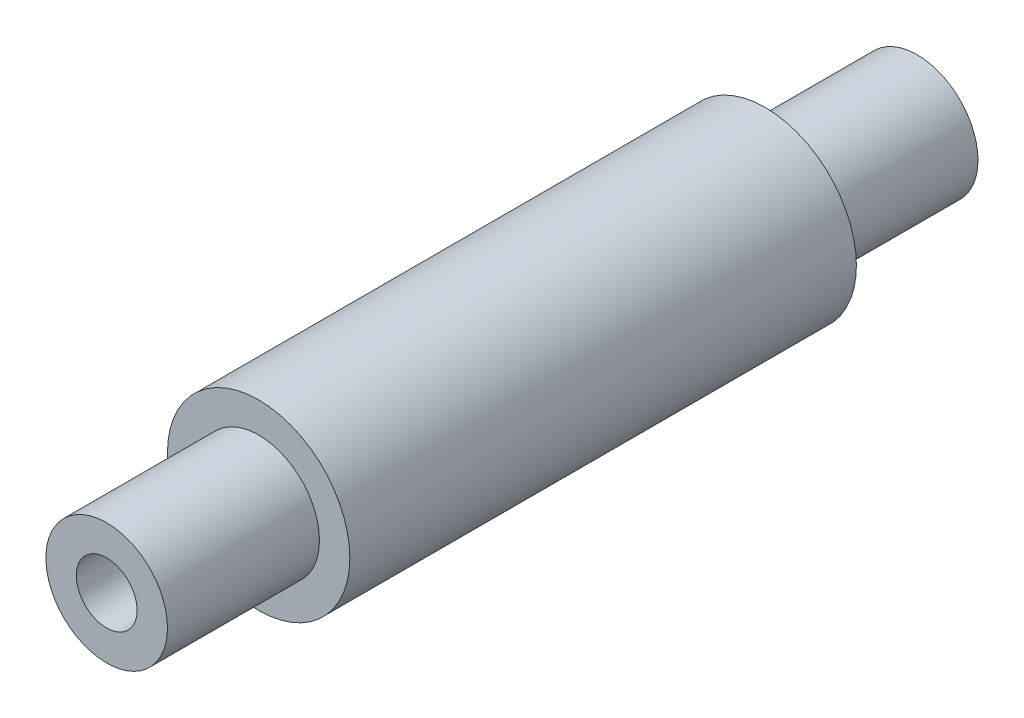
ISO-10303-21;
HEADER;
FILE_DESCRIPTION(('STEP AP214'),'2;1');
FILE_NAME('part.step','',(''),(''),'','','');
FILE_SCHEMA(('AUTOMOTIVE_DESIGN { 1 0 10303 214 1 1 1 1 }'));
ENDSEC;
DATA;
#1=APPLICATION_CONTEXT('core data for automotive mechanical design processes');
#2=APPLICATION_PROTOCOL_DEFINITION('international standard','automotive_design',2000,#1);
#3=PRODUCT_CONTEXT('',#1,'mechanical');
#4=PRODUCT('Part','Part','',(#3));
#5=PRODUCT_RELATED_PRODUCT_CATEGORY('part','',(#4));
#6=PRODUCT_DEFINITION_FORMATION('','',#4);
#7=PRODUCT_DEFINITION_CONTEXT('part definition',#1,'design');
#8=PRODUCT_DEFINITION('design','',#6,#7);
#9=PRODUCT_DEFINITION_SHAPE('','',#8);
#10=(LENGTH_UNIT() NAMED_UNIT(*) SI_UNIT(.MILLI.,.METRE.));
#11=(NAMED_UNIT(*) PLANE_ANGLE_UNIT() SI_UNIT($,.RADIAN.));
#12=(NAMED_UNIT(*) SI_UNIT($,.STERADIAN.) SOLID_ANGLE_UNIT());
#13=UNCERTAINTY_MEASURE_WITH_UNIT(LENGTH_MEASURE(1.E-05),#10,'distance_accuracy_value','');
#14=(GEOMETRIC_REPRESENTATION_CONTEXT(3) GLOBAL_UNCERTAINTY_ASSIGNED_CONTEXT((#13)) GLOBAL_UNIT_ASSIGNED_CONTEXT((#10,
#11,#12)) REPRESENTATION_CONTEXT('',''));
#15=CARTESIAN_POINT('',(0.,0.,0.));
#16=DIRECTION('',(0.,0.,1.));
#17=DIRECTION('',(1.,0.,0.));
#18=AXIS2_PLACEMENT_3D('',#15,#16,#17);
#19=CARTESIAN_POINT('',(0.,0.,40.));
#20=DIRECTION('',(0.,0.,-1.));
#21=DIRECTION('',(-1.,0.,0.));
#22=AXIS2_PLACEMENT_3D('',#19,#20,#21);
#23=CYLINDRICAL_SURFACE('',#22,6.);
#24=CARTESIAN_POINT('',(0.,0.,25.));
#25=DIRECTION('',(0.,0.,1.));
#26=DIRECTION('',(1.,0.,0.));
#27=AXIS2_PLACEMENT_3D('',#24,#25,#26);
#28=CIRCLE('',#27,6.);
#29=CARTESIAN_POINT('',(6.,0.,25.));
#30=VERTEX_POINT('',#29);
#31=EDGE_CURVE('E83',#30,#30,#28,.T.);
#32=ORIENTED_EDGE('',*,*,#31,.T.);
#33=EDGE_LOOP('',(#32));
#34=FACE_BOUND('',#33,.T.);
#35=CARTESIAN_POINT('',(0.,0.,40.));
#36=DIRECTION('',(0.,0.,1.));
#37=DIRECTION('',(1.,0.,0.));
#38=AXIS2_PLACEMENT_3D('',#35,#36,#37);
#39=CIRCLE('',#38,6.);
#40=CARTESIAN_POINT('',(6.,0.,40.));
#41=VERTEX_POINT('',#40);
#42=EDGE_CURVE('E86',#41,#41,#39,.T.);
#43=ORIENTED_EDGE('',*,*,#42,.F.);
#44=EDGE_LOOP('',(#43));
#45=FACE_BOUND('',#44,.T.);
#46=ADVANCED_FACE('F42',(#34,#45),#23,.T.);
#47=CARTESIAN_POINT('',(0.,0.,40.));
#48=DIRECTION('',(0.,0.,1.));
#49=DIRECTION('',(1.,0.,0.));
#50=AXIS2_PLACEMENT_3D('',#47,#48,#49);
#51=PLANE('',#50);
#52=CARTESIAN_POINT('',(0.,0.,40.));
#53=DIRECTION('',(0.,0.,1.));
#54=DIRECTION('',(1.,0.,0.));
#55=AXIS2_PLACEMENT_3D('',#52,#53,#54);
#56=CIRCLE('',#55,3.);
#57=CARTESIAN_POINT('',(3.,0.,40.));
#58=VERTEX_POINT('',#57);
#59=EDGE_CURVE('E71',#58,#58,#56,.T.);
#60=ORIENTED_EDGE('',*,*,#59,.F.);
#61=EDGE_LOOP('',(#60));
#62=FACE_BOUND('',#61,.T.);
#63=ORIENTED_EDGE('',*,*,#42,.T.);
#64=EDGE_LOOP('',(#63));
#65=FACE_BOUND('',#64,.T.);
#66=ADVANCED_FACE('F109',(#62,#65),#51,.T.);
#67=CARTESIAN_POINT('',(0.,0.,25.));
#68=DIRECTION('',(0.,0.,-1.));
#69=DIRECTION('',(-1.,0.,0.));
#70=AXIS2_PLACEMENT_3D('',#67,#68,#69);
#71=CYLINDRICAL_SURFACE('',#70,9.);
#72=CARTESIAN_POINT('',(-9.,0.,-3.));
#73=CARTESIAN_POINT('',(-9.00000045902832,0.16369008866017,-3.00000076119492));
#74=CARTESIAN_POINT('',(-8.99549308522634,0.32737558361565,-2.98655920161835));
#75=CARTESIAN_POINT('',(-8.97795630609842,0.649925282618917,-2.93331267354834));
#76=CARTESIAN_POINT('',(-8.96492601606458,0.808788984356453,-2.89350496815323));
#77=CARTESIAN_POINT('',(-8.93175923719328,1.11699836850533,-2.78904226984785));
#78=CARTESIAN_POINT('',(-8.9116346319256,1.2663594776581,-2.72442881262218));
#79=CARTESIAN_POINT('',(-8.86633337152025,1.55212481041597,-2.57237648148496));
#80=CARTESIAN_POINT('',(-8.84115572003334,1.68852647087612,-2.4849331049922));
#81=CARTESIAN_POINT('',(-8.78742283329015,1.9492250250668,-2.28652258542374));
#82=CARTESIAN_POINT('',(-8.75878669391354,2.07301110089493,-2.17490629721852));
#83=CARTESIAN_POINT('',(-8.70180944349364,2.30049807810625,-1.9326985358803));
#84=CARTESIAN_POINT('',(-8.67346839871647,2.40419455646839,-1.80210289521446));
#85=CARTESIAN_POINT('',(-8.61939997431821,2.59147482668358,-1.52104465441062));
#86=CARTESIAN_POINT('',(-8.59377117827064,2.6743945746631,-1.37011878080363));
#87=CARTESIAN_POINT('',(-8.54925916255804,2.81345662163316,-1.05547171662436));
#88=CARTESIAN_POINT('',(-8.53037388482237,2.86960709216029,-0.891754448511768));
#89=CARTESIAN_POINT('',(-8.50233909808132,2.95162038452749,-0.561980335509868));
#90=CARTESIAN_POINT('',(-8.49288287308834,2.97844034481531,-0.396188374532806));
#91=CARTESIAN_POINT('',(-8.48386969888523,3.00402337000343,-0.0622087375323572));
#92=CARTESIAN_POINT('',(-8.4843096906819,3.00279510481415,0.105978182127571));
#93=CARTESIAN_POINT('',(-8.49477045024541,2.97305971111026,0.431809891332063));
#94=CARTESIAN_POINT('',(-8.50435247602599,2.94580173950098,0.589585208757056));
#95=CARTESIAN_POINT('',(-8.53129973173653,2.86681848854825,0.898180258820503));
#96=CARTESIAN_POINT('',(-8.54866589352323,2.81509027977561,1.04899915630521));
#97=CARTESIAN_POINT('',(-8.58953733393746,2.68781717418063,1.34223824877444));
#98=CARTESIAN_POINT('',(-8.61313697379352,2.61190214612179,1.48448407640858));
#99=CARTESIAN_POINT('',(-8.66377675727179,2.43866731890942,1.75461272483918));
#100=CARTESIAN_POINT('',(-8.69081789371391,2.34134133709202,1.88249138080014));
#101=CARTESIAN_POINT('',(-8.74701987503223,2.12204799804671,2.12727479448232));
#102=CARTESIAN_POINT('',(-8.77621768064528,1.99905945022893,2.24325808352721));
#103=CARTESIAN_POINT('',(-8.8322081516111,1.73501870991019,2.45319379999019));
#104=CARTESIAN_POINT('',(-8.85900058614202,1.59396478698244,2.54714411449349));
#105=CARTESIAN_POINT('',(-8.90751323813381,1.2958428391388,2.7110889007052));
#106=CARTESIAN_POINT('',(-8.92918050024118,1.13862982924901,2.78083647402219));
#107=CARTESIAN_POINT('',(-8.96461701433304,0.813807250093523,2.89260952186713));
#108=CARTESIAN_POINT('',(-8.97838900964638,0.646201314464861,2.93464462627031));
#109=CARTESIAN_POINT('',(-8.99602881214321,0.313151488587913,2.98816699806708));
#110=CARTESIAN_POINT('',(-9.00030005501184,0.14792879959454,3.00089942751825));
#111=CARTESIAN_POINT('',(-8.99966708084482,-0.182325209880711,2.99900197920459));
#112=CARTESIAN_POINT('',(-8.99476441258087,-0.34735655795895,2.98437672006037));
#113=CARTESIAN_POINT('',(-8.97660074151313,-0.667559598912766,2.92916427679212));
#114=CARTESIAN_POINT('',(-8.96358596133577,-0.822878420504529,2.88934138185152));
#115=CARTESIAN_POINT('',(-8.9307554049021,-1.12456787573872,2.78581966659981));
#116=CARTESIAN_POINT('',(-8.91093876140025,-1.27093736552582,2.72211780159664));
#117=CARTESIAN_POINT('',(-8.86586793861869,-1.55486488917982,2.57078870447764));
#118=CARTESIAN_POINT('',(-8.84048444267358,-1.69208987765144,2.48257622015049));
#119=CARTESIAN_POINT('',(-8.78715761748787,-1.95019449040676,2.28541754995955));
#120=CARTESIAN_POINT('',(-8.75921350781483,-2.07106910338673,2.1764650319047));
#121=CARTESIAN_POINT('',(-8.70230543941334,-2.2987575234189,1.93506374698024));
#122=CARTESIAN_POINT('',(-8.67335283262284,-2.40468290773731,1.80177231921942));
#123=CARTESIAN_POINT('',(-8.61899919884126,-2.59277256697072,1.51868529656734));
#124=CARTESIAN_POINT('',(-8.59359820146007,-2.67493664379304,1.36888956409777));
#125=CARTESIAN_POINT('',(-8.54947175374151,-2.81279079124908,1.05698095413031));
#126=CARTESIAN_POINT('',(-8.53073282378936,-2.86853439649506,0.894893762493704));
#127=CARTESIAN_POINT('',(-8.50232496919349,-2.95168400027807,0.562864049867609));
#128=CARTESIAN_POINT('',(-8.49265195870918,-2.97910276486182,0.392925103786952));
#129=CARTESIAN_POINT('',(-8.48393576622531,-3.00382884743203,0.0594087118772523));
#130=CARTESIAN_POINT('',(-8.48437200772245,-3.0026107719252,-0.104047020860469));
#131=CARTESIAN_POINT('',(-8.49453809471602,-2.97372688034608,-0.428295224766186));
#132=CARTESIAN_POINT('',(-8.50426738708085,-2.94606263837576,-0.589087853865264));
#133=CARTESIAN_POINT('',(-8.53153572914675,-2.86611543938804,-0.900406989007415));
#134=CARTESIAN_POINT('',(-8.54892294067433,-2.81431003804654,-1.05107047501349));
#135=CARTESIAN_POINT('',(-8.58949196455406,-2.68793809727924,-1.34168222081481));
#136=CARTESIAN_POINT('',(-8.61267506290179,-2.61336650566142,-1.48162809356402));
#137=CARTESIAN_POINT('',(-8.66348487678139,-2.43978207775029,-1.75345100976873));
#138=CARTESIAN_POINT('',(-8.69126134926411,-2.33984472829374,-1.88470950569516));
#139=CARTESIAN_POINT('',(-8.74750068849758,-2.11992864940695,-2.1290694401526));
#140=CARTESIAN_POINT('',(-8.77596374737117,-1.99994425335445,-2.24216572706422));
#141=CARTESIAN_POINT('',(-8.83170091576632,-1.73772467076207,-2.45143323686753));
#142=CARTESIAN_POINT('',(-8.8588854540377,-1.59480454049919,-2.546773043253));
#143=CARTESIAN_POINT('',(-8.90777973517836,-1.29407207221987,-2.71197128655194));
#144=CARTESIAN_POINT('',(-8.92949087723789,-1.13626355439705,-2.78183623776613));
#145=CARTESIAN_POINT('',(-8.96416545205625,-0.817480941602929,-2.89116489746601));
#146=CARTESIAN_POINT('',(-8.97747637267568,-0.656963273029228,-2.93184739879013));
#147=CARTESIAN_POINT('',(-8.99539221192665,-0.330961248030743,-2.98626084203138));
#148=CARTESIAN_POINT('',(-8.99999953595715,-0.16547827670624,-2.99999923048961));
#149=CARTESIAN_POINT('',(-9.,0.,-3.));
#150=B_SPLINE_CURVE_WITH_KNOTS('',3,(#72,#73,#74,#75,#76,#77,#78,#79,#80,#81,#82,#83,#84,#85,
#86,#87,#88,#89,#90,#91,#92,#93,#94,#95,#96,#97,#98,#99,#100,#101,#102,#103,#104,#105,#106,#107,
#108,#109,#110,#111,#112,#113,#114,#115,#116,#117,#118,#119,#120,#121,#122,#123,#124,#125,#126,
#127,#128,#129,#130,#131,#132,#133,#134,#135,#136,#137,#138,#139,#140,#141,#142,#143,#144,#145,
#146,#147,#148,#149),.UNSPECIFIED.,.T.,.F.,(4,2,2,2,2,2,2,2,2,2,2,2,2,2,2,2,2,2,2,2,2,2,2,2,2,2,
2,2,2,2,2,2,2,2,2,2,2,2,4),(0.,0.490461318078033,0.980973555802562,1.47066801861082,
1.9604591333973,2.46554052848268,2.97073299862591,3.49045154470411,4.010011340785,
4.5120577722552,5.01394901962456,5.49290479653841,5.97191792566446,6.45864513465392,
6.94551307674621,7.45779917434101,7.97013437899855,8.48755216951072,9.00479006631624,
9.49960749525508,9.99434139492529,10.4747447393464,10.9552093585231,11.4483119953121,
11.9415654246567,12.4572306864225,12.9729002470499,13.4875204148031,14.0019085411752,
14.4898699819277,14.9778023805412,15.4564676124125,15.9352391452793,16.4349020007541,
16.9347063337134,17.453989825053,17.9731404345737,18.4690967512144,18.9649159811442),.UNSPECIFIED.);
#151=CARTESIAN_POINT('',(-9.,0.,-3.));
#152=VERTEX_POINT('',#151);
#153=EDGE_CURVE('E73',#152,#152,#150,.T.);
#154=ORIENTED_EDGE('',*,*,#153,.T.);
#155=EDGE_LOOP('',(#154));
#156=FACE_BOUND('',#155,.T.);
#157=CARTESIAN_POINT('',(0.,0.,25.));
#158=DIRECTION('',(0.,0.,1.));
#159=DIRECTION('',(1.,0.,0.));
#160=AXIS2_PLACEMENT_3D('',#157,#158,#159);
#161=CIRCLE('',#160,9.);
#162=CARTESIAN_POINT('',(9.,0.,25.));
#163=VERTEX_POINT('',#162);
#164=EDGE_CURVE('E80',#163,#163,#161,.T.);
#165=ORIENTED_EDGE('',*,*,#164,.F.);
#166=EDGE_LOOP('',(#165));
#167=FACE_BOUND('',#166,.T.);
#168=CARTESIAN_POINT('',(0.,0.,-25.));
#169=DIRECTION('',(0.,0.,1.));
#170=DIRECTION('',(1.,0.,0.));
#171=AXIS2_PLACEMENT_3D('',#168,#169,#170);
#172=CIRCLE('',#171,9.);
#173=CARTESIAN_POINT('',(9.,0.,-25.));
#174=VERTEX_POINT('',#173);
#175=EDGE_CURVE('E75',#174,#174,#172,.T.);
#176=ORIENTED_EDGE('',*,*,#175,.T.);
#177=EDGE_LOOP('',(#176));
#178=FACE_BOUND('',#177,.T.);
#179=ADVANCED_FACE('F103',(#156,#167,#178),#71,.T.);
#180=CARTESIAN_POINT('',(0.,0.,25.));
#181=DIRECTION('',(0.,0.,1.));
#182=DIRECTION('',(1.,0.,0.));
#183=AXIS2_PLACEMENT_3D('',#180,#181,#182);
#184=PLANE('',#183);
#185=ORIENTED_EDGE('',*,*,#31,.F.);
#186=EDGE_LOOP('',(#185));
#187=FACE_BOUND('',#186,.T.);
#188=ORIENTED_EDGE('',*,*,#164,.T.);
#189=EDGE_LOOP('',(#188));
#190=FACE_BOUND('',#189,.T.);
#191=ADVANCED_FACE('F99',(#187,#190),#184,.T.);
#192=CARTESIAN_POINT('',(0.,0.,-25.));
#193=DIRECTION('',(0.,0.,1.));
#194=DIRECTION('',(1.,0.,0.));
#195=AXIS2_PLACEMENT_3D('',#192,#193,#194);
#196=PLANE('',#195);
#197=CARTESIAN_POINT('',(0.,0.,-25.));
#198=DIRECTION('',(0.,0.,1.));
#199=DIRECTION('',(1.,0.,0.));
#200=AXIS2_PLACEMENT_3D('',#197,#198,#199);
#201=CIRCLE('',#200,6.);
#202=CARTESIAN_POINT('',(6.,0.,-25.));
#203=VERTEX_POINT('',#202);
#204=EDGE_CURVE('E58',#203,#203,#201,.T.);
#205=ORIENTED_EDGE('',*,*,#204,.T.);
#206=EDGE_LOOP('',(#205));
#207=FACE_BOUND('',#206,.T.);
#208=ORIENTED_EDGE('',*,*,#175,.F.);
#209=EDGE_LOOP('',(#208));
#210=FACE_BOUND('',#209,.T.);
#211=ADVANCED_FACE('F102',(#207,#210),#196,.F.);
#212=CARTESIAN_POINT('',(0.,0.,-40.));
#213=DIRECTION('',(0.,0.,1.));
#214=DIRECTION('',(1.,0.,0.));
#215=AXIS2_PLACEMENT_3D('',#212,#213,#214);
#216=PLANE('',#215);
#217=CARTESIAN_POINT('',(0.,0.,-40.));
#218=DIRECTION('',(0.,0.,1.));
#219=DIRECTION('',(1.,0.,0.));
#220=AXIS2_PLACEMENT_3D('',#217,#218,#219);
#221=CIRCLE('',#220,6.);
#222=CARTESIAN_POINT('',(6.,0.,-40.));
#223=VERTEX_POINT('',#222);
#224=EDGE_CURVE('E89',#223,#223,#221,.T.);
#225=ORIENTED_EDGE('',*,*,#224,.F.);
#226=EDGE_LOOP('',(#225));
#227=FACE_BOUND('',#226,.T.);
#228=ADVANCED_FACE('F115',(#227),#216,.F.);
#229=ORIENTED_EDGE('',*,*,#224,.T.);
#230=EDGE_LOOP('',(#229));
#231=FACE_BOUND('',#230,.T.);
#232=ORIENTED_EDGE('',*,*,#204,.F.);
#233=EDGE_LOOP('',(#232));
#234=FACE_BOUND('',#233,.T.);
#235=ADVANCED_FACE('F63',(#231,#234),#23,.T.);
#236=CARTESIAN_POINT('',(0.,0.,-5.));
#237=DIRECTION('',(0.,0.,1.));
#238=DIRECTION('',(1.,0.,0.));
#239=AXIS2_PLACEMENT_3D('',#236,#237,#238);
#240=CYLINDRICAL_SURFACE('',#239,3.);
#241=CARTESIAN_POINT('',(0.,0.,0.));
#242=DIRECTION('',(-0.707106781186548,0.,0.707106781186547));
#243=DIRECTION('',(0.707106781186548,0.,0.707106781186547));
#244=AXIS2_PLACEMENT_3D('',#241,#242,#243);
#245=ELLIPSE('',#244,4.24264068711928,3.);
#246=CARTESIAN_POINT('',(0.,3.,0.));
#247=VERTEX_POINT('',#246);
#248=CARTESIAN_POINT('',(0.,-3.,0.));
#249=VERTEX_POINT('',#248);
#250=EDGE_CURVE('E49',#247,#249,#245,.T.);
#251=ORIENTED_EDGE('',*,*,#250,.T.);
#252=CARTESIAN_POINT('',(0.,0.,0.));
#253=DIRECTION('',(0.707106781186548,0.,0.707106781186547));
#254=DIRECTION('',(-0.707106781186548,0.,0.707106781186547));
#255=AXIS2_PLACEMENT_3D('',#252,#253,#254);
#256=ELLIPSE('',#255,4.24264068711928,3.);
#257=EDGE_CURVE('E11',#249,#247,#256,.F.);
#258=ORIENTED_EDGE('',*,*,#257,.T.);
#259=EDGE_LOOP('',(#251,#258));
#260=FACE_BOUND('',#259,.T.);
#261=CARTESIAN_POINT('',(0.,0.,-5.));
#262=DIRECTION('',(0.,0.,1.));
#263=DIRECTION('',(1.,0.,0.));
#264=AXIS2_PLACEMENT_3D('',#261,#262,#263);
#265=CIRCLE('',#264,3.);
#266=CARTESIAN_POINT('',(3.,0.,-5.));
#267=VERTEX_POINT('',#266);
#268=EDGE_CURVE('E68',#267,#267,#265,.T.);
#269=ORIENTED_EDGE('',*,*,#268,.F.);
#270=EDGE_LOOP('',(#269));
#271=FACE_BOUND('',#270,.T.);
#272=ORIENTED_EDGE('',*,*,#59,.T.);
#273=EDGE_LOOP('',(#272));
#274=FACE_BOUND('',#273,.T.);
#275=ADVANCED_FACE('F59',(#260,#271,#274),#240,.F.);
#276=CARTESIAN_POINT('',(0.,0.,-5.));
#277=DIRECTION('',(0.,0.,1.));
#278=DIRECTION('',(1.,0.,0.));
#279=AXIS2_PLACEMENT_3D('',#276,#277,#278);
#280=PLANE('',#279);
#281=ORIENTED_EDGE('',*,*,#268,.T.);
#282=EDGE_LOOP('',(#281));
#283=FACE_BOUND('',#282,.T.);
#284=ADVANCED_FACE('F62',(#283),#280,.T.);
#285=CARTESIAN_POINT('',(-9.,0.,0.));
#286=DIRECTION('',(1.,0.,0.));
#287=DIRECTION('',(0.,0.,-1.));
#288=AXIS2_PLACEMENT_3D('',#285,#286,#287);
#289=CYLINDRICAL_SURFACE('',#288,3.);
#290=ORIENTED_EDGE('',*,*,#250,.F.);
#291=ORIENTED_EDGE('',*,*,#257,.F.);
#292=EDGE_LOOP('',(#290,#291));
#293=FACE_BOUND('',#292,.T.);
#294=ORIENTED_EDGE('',*,*,#153,.F.);
#295=EDGE_LOOP('',(#294));
#296=FACE_BOUND('',#295,.T.);
#297=ADVANCED_FACE('F55',(#293,#296),#289,.F.);
#298=CLOSED_SHELL('',(#46,#66,#179,#191,#211,#228,#235,#275,#284,#297));
#299=MANIFOLD_SOLID_BREP('B2',#298);
#300=ADVANCED_BREP_SHAPE_REPRESENTATION('',(#18,#299),#14);
#301=SHAPE_DEFINITION_REPRESENTATION(#9,#300);
ENDSEC;
END-ISO-10303-21;
